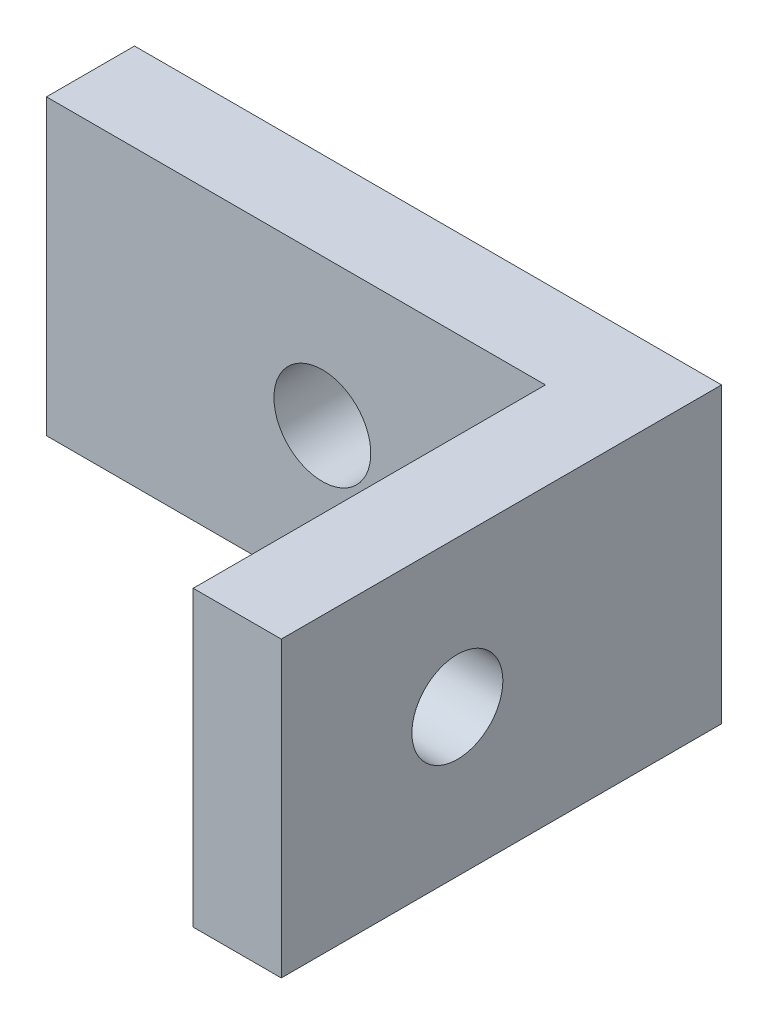
ISO-10303-21;
HEADER;
FILE_DESCRIPTION(('STEP AP214'),'2;1');
FILE_NAME('part.step','',(''),(''),'','','');
FILE_SCHEMA(('AUTOMOTIVE_DESIGN { 1 0 10303 214 1 1 1 1 }'));
ENDSEC;
DATA;
#1=APPLICATION_CONTEXT('core data for automotive mechanical design processes');
#2=APPLICATION_PROTOCOL_DEFINITION('international standard','automotive_design',2000,#1);
#3=PRODUCT_CONTEXT('',#1,'mechanical');
#4=PRODUCT('Part','Part','',(#3));
#5=PRODUCT_RELATED_PRODUCT_CATEGORY('part','',(#4));
#6=PRODUCT_DEFINITION_FORMATION('','',#4);
#7=PRODUCT_DEFINITION_CONTEXT('part definition',#1,'design');
#8=PRODUCT_DEFINITION('design','',#6,#7);
#9=PRODUCT_DEFINITION_SHAPE('','',#8);
#10=(LENGTH_UNIT() NAMED_UNIT(*) SI_UNIT(.MILLI.,.METRE.));
#11=(NAMED_UNIT(*) PLANE_ANGLE_UNIT() SI_UNIT($,.RADIAN.));
#12=(NAMED_UNIT(*) SI_UNIT($,.STERADIAN.) SOLID_ANGLE_UNIT());
#13=UNCERTAINTY_MEASURE_WITH_UNIT(LENGTH_MEASURE(1.E-05),#10,'distance_accuracy_value','');
#14=(GEOMETRIC_REPRESENTATION_CONTEXT(3) GLOBAL_UNCERTAINTY_ASSIGNED_CONTEXT((#13)) GLOBAL_UNIT_ASSIGNED_CONTEXT((#10,
#11,#12)) REPRESENTATION_CONTEXT('',''));
#15=CARTESIAN_POINT('',(0.,0.,0.));
#16=DIRECTION('',(0.,0.,1.));
#17=DIRECTION('',(1.,0.,0.));
#18=AXIS2_PLACEMENT_3D('',#15,#16,#17);
#19=CARTESIAN_POINT('',(0.,10.,-3.));
#20=DIRECTION('',(1.,0.,0.));
#21=DIRECTION('',(0.,0.,-1.));
#22=AXIS2_PLACEMENT_3D('',#19,#20,#21);
#23=PLANE('',#22);
#24=DIRECTION('',(0.,0.,1.));
#25=VECTOR('',#24,1.);
#26=CARTESIAN_POINT('',(0.,0.,-3.));
#27=LINE('',#26,#25);
#28=CARTESIAN_POINT('',(0.,0.,-3.));
#29=VERTEX_POINT('',#28);
#30=CARTESIAN_POINT('',(0.,0.,0.));
#31=VERTEX_POINT('',#30);
#32=EDGE_CURVE('E118',#29,#31,#27,.T.);
#33=ORIENTED_EDGE('',*,*,#32,.T.);
#34=DIRECTION('',(0.,-1.,0.));
#35=VECTOR('',#34,1.);
#36=CARTESIAN_POINT('',(0.,10.,0.));
#37=LINE('',#36,#35);
#38=CARTESIAN_POINT('',(0.,10.,0.));
#39=VERTEX_POINT('',#38);
#40=EDGE_CURVE('E11',#39,#31,#37,.T.);
#41=ORIENTED_EDGE('',*,*,#40,.F.);
#42=DIRECTION('',(0.,0.,1.));
#43=VECTOR('',#42,1.);
#44=CARTESIAN_POINT('',(0.,10.,-3.));
#45=LINE('',#44,#43);
#46=CARTESIAN_POINT('',(0.,10.,-3.));
#47=VERTEX_POINT('',#46);
#48=EDGE_CURVE('E129',#47,#39,#45,.T.);
#49=ORIENTED_EDGE('',*,*,#48,.F.);
#50=DIRECTION('',(0.,-1.,0.));
#51=VECTOR('',#50,1.);
#52=CARTESIAN_POINT('',(0.,10.,-3.));
#53=LINE('',#52,#51);
#54=EDGE_CURVE('E114',#47,#29,#53,.T.);
#55=ORIENTED_EDGE('',*,*,#54,.T.);
#56=EDGE_LOOP('',(#33,#41,#49,#55));
#57=FACE_BOUND('',#56,.T.);
#58=ADVANCED_FACE('F34',(#57),#23,.F.);
#59=CARTESIAN_POINT('',(0.,10.,0.));
#60=DIRECTION('',(0.,0.,-1.));
#61=DIRECTION('',(-1.,0.,0.));
#62=AXIS2_PLACEMENT_3D('',#59,#60,#61);
#63=PLANE('',#62);
#64=CARTESIAN_POINT('',(9.4,5.,0.));
#65=DIRECTION('',(0.,0.,-1.));
#66=DIRECTION('',(-1.,0.,0.));
#67=AXIS2_PLACEMENT_3D('',#64,#65,#66);
#68=CIRCLE('',#67,1.65);
#69=CARTESIAN_POINT('',(7.75,5.,0.));
#70=VERTEX_POINT('',#69);
#71=EDGE_CURVE('E229',#70,#70,#68,.F.);
#72=ORIENTED_EDGE('',*,*,#71,.F.);
#73=EDGE_LOOP('',(#72));
#74=FACE_BOUND('',#73,.T.);
#75=DIRECTION('',(1.,0.,0.));
#76=VECTOR('',#75,1.);
#77=CARTESIAN_POINT('',(0.,0.,0.));
#78=LINE('',#77,#76);
#79=CARTESIAN_POINT('',(17.,0.,0.));
#80=VERTEX_POINT('',#79);
#81=EDGE_CURVE('E121',#31,#80,#78,.T.);
#82=ORIENTED_EDGE('',*,*,#81,.T.);
#83=DIRECTION('',(0.,-1.,0.));
#84=VECTOR('',#83,1.);
#85=CARTESIAN_POINT('',(17.,10.,0.));
#86=LINE('',#85,#84);
#87=CARTESIAN_POINT('',(17.,10.,0.));
#88=VERTEX_POINT('',#87);
#89=EDGE_CURVE('E42',#88,#80,#86,.T.);
#90=ORIENTED_EDGE('',*,*,#89,.F.);
#91=DIRECTION('',(1.,0.,0.));
#92=VECTOR('',#91,1.);
#93=CARTESIAN_POINT('',(0.,10.,0.));
#94=LINE('',#93,#92);
#95=EDGE_CURVE('E87',#39,#88,#94,.T.);
#96=ORIENTED_EDGE('',*,*,#95,.F.);
#97=ORIENTED_EDGE('',*,*,#40,.T.);
#98=EDGE_LOOP('',(#82,#90,#96,#97));
#99=FACE_BOUND('',#98,.T.);
#100=ADVANCED_FACE('F156',(#74,#99),#63,.F.);
#101=CARTESIAN_POINT('',(17.,10.,0.));
#102=DIRECTION('',(1.,0.,0.));
#103=DIRECTION('',(0.,0.,-1.));
#104=AXIS2_PLACEMENT_3D('',#101,#102,#103);
#105=PLANE('',#104);
#106=CARTESIAN_POINT('',(17.,5.,6.));
#107=DIRECTION('',(1.,0.,0.));
#108=DIRECTION('',(0.,0.,-1.));
#109=AXIS2_PLACEMENT_3D('',#106,#107,#108);
#110=CIRCLE('',#109,1.55);
#111=CARTESIAN_POINT('',(17.,5.,4.45));
#112=VERTEX_POINT('',#111);
#113=EDGE_CURVE('E122',#112,#112,#110,.F.);
#114=ORIENTED_EDGE('',*,*,#113,.F.);
#115=EDGE_LOOP('',(#114));
#116=FACE_BOUND('',#115,.T.);
#117=DIRECTION('',(0.,0.,1.));
#118=VECTOR('',#117,1.);
#119=CARTESIAN_POINT('',(17.,0.,0.));
#120=LINE('',#119,#118);
#121=CARTESIAN_POINT('',(17.,0.,12.));
#122=VERTEX_POINT('',#121);
#123=EDGE_CURVE('E124',#80,#122,#120,.T.);
#124=ORIENTED_EDGE('',*,*,#123,.T.);
#125=DIRECTION('',(0.,-1.,0.));
#126=VECTOR('',#125,1.);
#127=CARTESIAN_POINT('',(17.,10.,12.));
#128=LINE('',#127,#126);
#129=CARTESIAN_POINT('',(17.,10.,12.));
#130=VERTEX_POINT('',#129);
#131=EDGE_CURVE('E109',#130,#122,#128,.T.);
#132=ORIENTED_EDGE('',*,*,#131,.F.);
#133=DIRECTION('',(0.,0.,1.));
#134=VECTOR('',#133,1.);
#135=CARTESIAN_POINT('',(17.,10.,0.));
#136=LINE('',#135,#134);
#137=EDGE_CURVE('E100',#88,#130,#136,.T.);
#138=ORIENTED_EDGE('',*,*,#137,.F.);
#139=ORIENTED_EDGE('',*,*,#89,.T.);
#140=EDGE_LOOP('',(#124,#132,#138,#139));
#141=FACE_BOUND('',#140,.T.);
#142=ADVANCED_FACE('F135',(#116,#141),#105,.F.);
#143=CARTESIAN_POINT('',(17.,10.,12.));
#144=DIRECTION('',(0.,0.,-1.));
#145=DIRECTION('',(-1.,0.,0.));
#146=AXIS2_PLACEMENT_3D('',#143,#144,#145);
#147=PLANE('',#146);
#148=DIRECTION('',(1.,0.,0.));
#149=VECTOR('',#148,1.);
#150=CARTESIAN_POINT('',(17.,0.,12.));
#151=LINE('',#150,#149);
#152=CARTESIAN_POINT('',(20.,0.,12.));
#153=VERTEX_POINT('',#152);
#154=EDGE_CURVE('E108',#122,#153,#151,.T.);
#155=ORIENTED_EDGE('',*,*,#154,.T.);
#156=DIRECTION('',(0.,-1.,0.));
#157=VECTOR('',#156,1.);
#158=CARTESIAN_POINT('',(20.,10.,12.));
#159=LINE('',#158,#157);
#160=CARTESIAN_POINT('',(20.,10.,12.));
#161=VERTEX_POINT('',#160);
#162=EDGE_CURVE('E105',#161,#153,#159,.T.);
#163=ORIENTED_EDGE('',*,*,#162,.F.);
#164=DIRECTION('',(1.,0.,0.));
#165=VECTOR('',#164,1.);
#166=CARTESIAN_POINT('',(17.,10.,12.));
#167=LINE('',#166,#165);
#168=EDGE_CURVE('E94',#130,#161,#167,.T.);
#169=ORIENTED_EDGE('',*,*,#168,.F.);
#170=ORIENTED_EDGE('',*,*,#131,.T.);
#171=EDGE_LOOP('',(#155,#163,#169,#170));
#172=FACE_BOUND('',#171,.T.);
#173=ADVANCED_FACE('F106',(#172),#147,.F.);
#174=CARTESIAN_POINT('',(20.,10.,12.));
#175=DIRECTION('',(-1.,0.,0.));
#176=DIRECTION('',(0.,0.,1.));
#177=AXIS2_PLACEMENT_3D('',#174,#175,#176);
#178=PLANE('',#177);
#179=CARTESIAN_POINT('',(20.,5.,6.));
#180=DIRECTION('',(1.,0.,0.));
#181=DIRECTION('',(0.,0.,-1.));
#182=AXIS2_PLACEMENT_3D('',#179,#180,#181);
#183=CIRCLE('',#182,1.55);
#184=CARTESIAN_POINT('',(20.,5.,4.45));
#185=VERTEX_POINT('',#184);
#186=EDGE_CURVE('E230',#185,#185,#183,.T.);
#187=ORIENTED_EDGE('',*,*,#186,.F.);
#188=EDGE_LOOP('',(#187));
#189=FACE_BOUND('',#188,.T.);
#190=DIRECTION('',(0.,0.,-1.));
#191=VECTOR('',#190,1.);
#192=CARTESIAN_POINT('',(20.,0.,12.));
#193=LINE('',#192,#191);
#194=CARTESIAN_POINT('',(20.,0.,-3.));
#195=VERTEX_POINT('',#194);
#196=EDGE_CURVE('E73',#153,#195,#193,.T.);
#197=ORIENTED_EDGE('',*,*,#196,.T.);
#198=DIRECTION('',(0.,-1.,0.));
#199=VECTOR('',#198,1.);
#200=CARTESIAN_POINT('',(20.,10.,-3.));
#201=LINE('',#200,#199);
#202=CARTESIAN_POINT('',(20.,10.,-3.));
#203=VERTEX_POINT('',#202);
#204=EDGE_CURVE('E110',#203,#195,#201,.T.);
#205=ORIENTED_EDGE('',*,*,#204,.F.);
#206=DIRECTION('',(0.,0.,-1.));
#207=VECTOR('',#206,1.);
#208=CARTESIAN_POINT('',(20.,10.,12.));
#209=LINE('',#208,#207);
#210=EDGE_CURVE('E98',#161,#203,#209,.T.);
#211=ORIENTED_EDGE('',*,*,#210,.F.);
#212=ORIENTED_EDGE('',*,*,#162,.T.);
#213=EDGE_LOOP('',(#197,#205,#211,#212));
#214=FACE_BOUND('',#213,.T.);
#215=ADVANCED_FACE('F112',(#189,#214),#178,.F.);
#216=CARTESIAN_POINT('',(20.,10.,-3.));
#217=DIRECTION('',(0.,0.,1.));
#218=DIRECTION('',(1.,0.,0.));
#219=AXIS2_PLACEMENT_3D('',#216,#217,#218);
#220=PLANE('',#219);
#221=CARTESIAN_POINT('',(9.4,5.,-3.));
#222=DIRECTION('',(0.,0.,-1.));
#223=DIRECTION('',(-1.,0.,0.));
#224=AXIS2_PLACEMENT_3D('',#221,#222,#223);
#225=CIRCLE('',#224,1.65);
#226=CARTESIAN_POINT('',(7.75,5.,-3.));
#227=VERTEX_POINT('',#226);
#228=EDGE_CURVE('E227',#227,#227,#225,.T.);
#229=ORIENTED_EDGE('',*,*,#228,.F.);
#230=EDGE_LOOP('',(#229));
#231=FACE_BOUND('',#230,.T.);
#232=DIRECTION('',(-1.,0.,0.));
#233=VECTOR('',#232,1.);
#234=CARTESIAN_POINT('',(20.,0.,-3.));
#235=LINE('',#234,#233);
#236=EDGE_CURVE('E79',#195,#29,#235,.T.);
#237=ORIENTED_EDGE('',*,*,#236,.T.);
#238=ORIENTED_EDGE('',*,*,#54,.F.);
#239=DIRECTION('',(-1.,0.,0.));
#240=VECTOR('',#239,1.);
#241=CARTESIAN_POINT('',(20.,10.,-3.));
#242=LINE('',#241,#240);
#243=EDGE_CURVE('E50',#203,#47,#242,.T.);
#244=ORIENTED_EDGE('',*,*,#243,.F.);
#245=ORIENTED_EDGE('',*,*,#204,.T.);
#246=EDGE_LOOP('',(#237,#238,#244,#245));
#247=FACE_BOUND('',#246,.T.);
#248=ADVANCED_FACE('F142',(#231,#247),#220,.F.);
#249=CARTESIAN_POINT('',(0.,10.,0.));
#250=DIRECTION('',(0.,1.,0.));
#251=DIRECTION('',(0.,0.,1.));
#252=AXIS2_PLACEMENT_3D('',#249,#250,#251);
#253=PLANE('',#252);
#254=ORIENTED_EDGE('',*,*,#48,.T.);
#255=ORIENTED_EDGE('',*,*,#95,.T.);
#256=ORIENTED_EDGE('',*,*,#137,.T.);
#257=ORIENTED_EDGE('',*,*,#168,.T.);
#258=ORIENTED_EDGE('',*,*,#210,.T.);
#259=ORIENTED_EDGE('',*,*,#243,.T.);
#260=EDGE_LOOP('',(#254,#255,#256,#257,#258,#259));
#261=FACE_BOUND('',#260,.T.);
#262=ADVANCED_FACE('F96',(#261),#253,.T.);
#263=CARTESIAN_POINT('',(0.,0.,0.));
#264=DIRECTION('',(0.,1.,0.));
#265=DIRECTION('',(0.,0.,1.));
#266=AXIS2_PLACEMENT_3D('',#263,#264,#265);
#267=PLANE('',#266);
#268=ORIENTED_EDGE('',*,*,#32,.F.);
#269=ORIENTED_EDGE('',*,*,#236,.F.);
#270=ORIENTED_EDGE('',*,*,#196,.F.);
#271=ORIENTED_EDGE('',*,*,#154,.F.);
#272=ORIENTED_EDGE('',*,*,#123,.F.);
#273=ORIENTED_EDGE('',*,*,#81,.F.);
#274=EDGE_LOOP('',(#268,#269,#270,#271,#272,#273));
#275=FACE_BOUND('',#274,.T.);
#276=ADVANCED_FACE('F138',(#275),#267,.F.);
#277=CARTESIAN_POINT('',(-0.001000000000001,5.,6.));
#278=DIRECTION('',(1.,0.,0.));
#279=DIRECTION('',(0.,0.,-1.));
#280=AXIS2_PLACEMENT_3D('',#277,#278,#279);
#281=CYLINDRICAL_SURFACE('',#280,1.55);
#282=ORIENTED_EDGE('',*,*,#186,.T.);
#283=EDGE_LOOP('',(#282));
#284=FACE_BOUND('',#283,.T.);
#285=ORIENTED_EDGE('',*,*,#113,.T.);
#286=EDGE_LOOP('',(#285));
#287=FACE_BOUND('',#286,.T.);
#288=ADVANCED_FACE('F187',(#284,#287),#281,.F.);
#289=CARTESIAN_POINT('',(9.4,5.,12.001));
#290=DIRECTION('',(0.,0.,-1.));
#291=DIRECTION('',(-1.,0.,0.));
#292=AXIS2_PLACEMENT_3D('',#289,#290,#291);
#293=CYLINDRICAL_SURFACE('',#292,1.65);
#294=ORIENTED_EDGE('',*,*,#228,.T.);
#295=EDGE_LOOP('',(#294));
#296=FACE_BOUND('',#295,.T.);
#297=ORIENTED_EDGE('',*,*,#71,.T.);
#298=EDGE_LOOP('',(#297));
#299=FACE_BOUND('',#298,.T.);
#300=ADVANCED_FACE('F191',(#296,#299),#293,.F.);
#301=CLOSED_SHELL('',(#58,#100,#142,#173,#215,#248,#262,#276,#288,#300));
#302=MANIFOLD_SOLID_BREP('B2',#301);
#303=ADVANCED_BREP_SHAPE_REPRESENTATION('',(#18,#302),#14);
#304=SHAPE_DEFINITION_REPRESENTATION(#9,#303);
ENDSEC;
END-ISO-10303-21;
